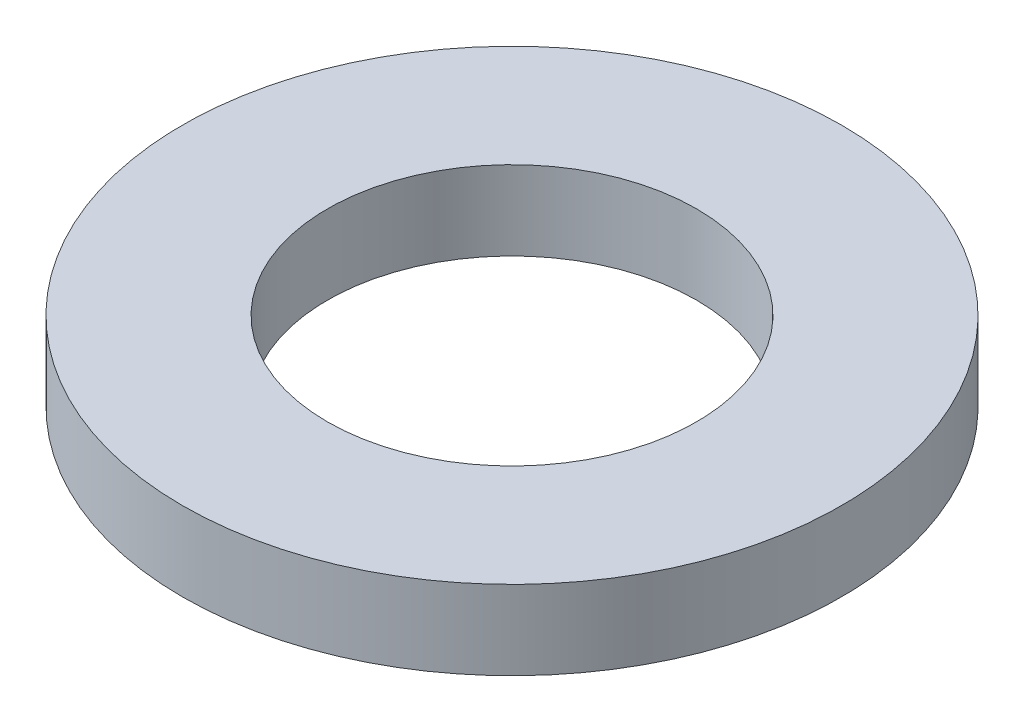
ISO-10303-21;
HEADER;
FILE_DESCRIPTION(('STEP AP214'),'2;1');
FILE_NAME('part.step','',(''),(''),'','','');
FILE_SCHEMA(('AUTOMOTIVE_DESIGN { 1 0 10303 214 1 1 1 1 }'));
ENDSEC;
DATA;
#1=APPLICATION_CONTEXT('core data for automotive mechanical design processes');
#2=APPLICATION_PROTOCOL_DEFINITION('international standard','automotive_design',2000,#1);
#3=PRODUCT_CONTEXT('',#1,'mechanical');
#4=PRODUCT('Part','Part','',(#3));
#5=PRODUCT_RELATED_PRODUCT_CATEGORY('part','',(#4));
#6=PRODUCT_DEFINITION_FORMATION('','',#4);
#7=PRODUCT_DEFINITION_CONTEXT('part definition',#1,'design');
#8=PRODUCT_DEFINITION('design','',#6,#7);
#9=PRODUCT_DEFINITION_SHAPE('','',#8);
#10=(LENGTH_UNIT() NAMED_UNIT(*) SI_UNIT(.MILLI.,.METRE.));
#11=(NAMED_UNIT(*) PLANE_ANGLE_UNIT() SI_UNIT($,.RADIAN.));
#12=(NAMED_UNIT(*) SI_UNIT($,.STERADIAN.) SOLID_ANGLE_UNIT());
#13=UNCERTAINTY_MEASURE_WITH_UNIT(LENGTH_MEASURE(1.E-05),#10,'distance_accuracy_value','');
#14=(GEOMETRIC_REPRESENTATION_CONTEXT(3) GLOBAL_UNCERTAINTY_ASSIGNED_CONTEXT((#13)) GLOBAL_UNIT_ASSIGNED_CONTEXT((#10,
#11,#12)) REPRESENTATION_CONTEXT('',''));
#15=CARTESIAN_POINT('',(0.,0.,0.));
#16=DIRECTION('',(0.,0.,1.));
#17=DIRECTION('',(1.,0.,0.));
#18=AXIS2_PLACEMENT_3D('',#15,#16,#17);
#19=CARTESIAN_POINT('',(0.,1.8,0.));
#20=DIRECTION('',(0.,1.,0.));
#21=DIRECTION('',(0.,0.,1.));
#22=AXIS2_PLACEMENT_3D('',#19,#20,#21);
#23=PLANE('',#22);
#24=CARTESIAN_POINT('',(0.,1.8,0.));
#25=DIRECTION('',(0.,1.,0.));
#26=DIRECTION('',(0.,0.,1.));
#27=AXIS2_PLACEMENT_3D('',#24,#25,#26);
#28=CIRCLE('',#27,7.5);
#29=CARTESIAN_POINT('',(0.,1.8,7.5));
#30=VERTEX_POINT('',#29);
#31=EDGE_CURVE('E10',#30,#30,#28,.T.);
#32=ORIENTED_EDGE('',*,*,#31,.T.);
#33=EDGE_LOOP('',(#32));
#34=FACE_BOUND('',#33,.T.);
#35=CARTESIAN_POINT('',(0.,1.8,0.));
#36=DIRECTION('',(0.,1.,0.));
#37=DIRECTION('',(0.,0.,1.));
#38=AXIS2_PLACEMENT_3D('',#35,#36,#37);
#39=CIRCLE('',#38,4.2);
#40=CARTESIAN_POINT('',(0.,1.8,4.2));
#41=VERTEX_POINT('',#40);
#42=EDGE_CURVE('E44',#41,#41,#39,.T.);
#43=ORIENTED_EDGE('',*,*,#42,.F.);
#44=EDGE_LOOP('',(#43));
#45=FACE_BOUND('',#44,.T.);
#46=ADVANCED_FACE('F33',(#34,#45),#23,.T.);
#47=CARTESIAN_POINT('',(0.,0.,0.));
#48=DIRECTION('',(0.,1.,0.));
#49=DIRECTION('',(0.,0.,1.));
#50=AXIS2_PLACEMENT_3D('',#47,#48,#49);
#51=PLANE('',#50);
#52=CARTESIAN_POINT('',(0.,0.,0.));
#53=DIRECTION('',(0.,1.,0.));
#54=DIRECTION('',(0.,0.,1.));
#55=AXIS2_PLACEMENT_3D('',#52,#53,#54);
#56=CIRCLE('',#55,7.5);
#57=CARTESIAN_POINT('',(0.,0.,7.5));
#58=VERTEX_POINT('',#57);
#59=EDGE_CURVE('E37',#58,#58,#56,.T.);
#60=ORIENTED_EDGE('',*,*,#59,.F.);
#61=EDGE_LOOP('',(#60));
#62=FACE_BOUND('',#61,.T.);
#63=CARTESIAN_POINT('',(0.,0.,0.));
#64=DIRECTION('',(0.,1.,0.));
#65=DIRECTION('',(0.,0.,1.));
#66=AXIS2_PLACEMENT_3D('',#63,#64,#65);
#67=CIRCLE('',#66,4.2);
#68=CARTESIAN_POINT('',(0.,0.,4.2));
#69=VERTEX_POINT('',#68);
#70=EDGE_CURVE('E46',#69,#69,#67,.T.);
#71=ORIENTED_EDGE('',*,*,#70,.T.);
#72=EDGE_LOOP('',(#71));
#73=FACE_BOUND('',#72,.T.);
#74=ADVANCED_FACE('F56',(#62,#73),#51,.F.);
#75=CARTESIAN_POINT('',(0.,1.8,0.));
#76=DIRECTION('',(0.,-1.,0.));
#77=DIRECTION('',(0.,0.,-1.));
#78=AXIS2_PLACEMENT_3D('',#75,#76,#77);
#79=CYLINDRICAL_SURFACE('',#78,7.5);
#80=ORIENTED_EDGE('',*,*,#31,.F.);
#81=EDGE_LOOP('',(#80));
#82=FACE_BOUND('',#81,.T.);
#83=ORIENTED_EDGE('',*,*,#59,.T.);
#84=EDGE_LOOP('',(#83));
#85=FACE_BOUND('',#84,.T.);
#86=ADVANCED_FACE('F35',(#82,#85),#79,.T.);
#87=CARTESIAN_POINT('',(0.,1.8,0.));
#88=DIRECTION('',(0.,-1.,0.));
#89=DIRECTION('',(0.,0.,-1.));
#90=AXIS2_PLACEMENT_3D('',#87,#88,#89);
#91=CYLINDRICAL_SURFACE('',#90,4.2);
#92=ORIENTED_EDGE('',*,*,#42,.T.);
#93=EDGE_LOOP('',(#92));
#94=FACE_BOUND('',#93,.T.);
#95=ORIENTED_EDGE('',*,*,#70,.F.);
#96=EDGE_LOOP('',(#95));
#97=FACE_BOUND('',#96,.T.);
#98=ADVANCED_FACE('F52',(#94,#97),#91,.F.);
#99=CLOSED_SHELL('',(#46,#74,#86,#98));
#100=MANIFOLD_SOLID_BREP('B2',#99);
#101=ADVANCED_BREP_SHAPE_REPRESENTATION('',(#18,#100),#14);
#102=SHAPE_DEFINITION_REPRESENTATION(#9,#101);
ENDSEC;
END-ISO-10303-21;
